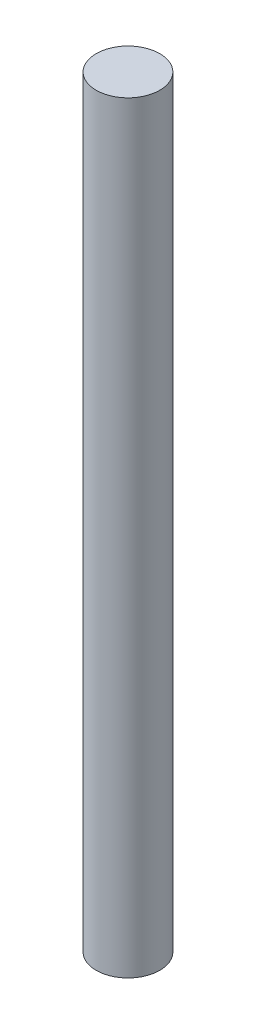
ISO-10303-21;
HEADER;
FILE_DESCRIPTION(('STEP AP214'),'2;1');
FILE_NAME('part.step','',(''),(''),'','','');
FILE_SCHEMA(('AUTOMOTIVE_DESIGN { 1 0 10303 214 1 1 1 1 }'));
ENDSEC;
DATA;
#1=APPLICATION_CONTEXT('core data for automotive mechanical design processes');
#2=APPLICATION_PROTOCOL_DEFINITION('international standard','automotive_design',2000,#1);
#3=PRODUCT_CONTEXT('',#1,'mechanical');
#4=PRODUCT('Part','Part','',(#3));
#5=PRODUCT_RELATED_PRODUCT_CATEGORY('part','',(#4));
#6=PRODUCT_DEFINITION_FORMATION('','',#4);
#7=PRODUCT_DEFINITION_CONTEXT('part definition',#1,'design');
#8=PRODUCT_DEFINITION('design','',#6,#7);
#9=PRODUCT_DEFINITION_SHAPE('','',#8);
#10=(LENGTH_UNIT() NAMED_UNIT(*) SI_UNIT(.MILLI.,.METRE.));
#11=(NAMED_UNIT(*) PLANE_ANGLE_UNIT() SI_UNIT($,.RADIAN.));
#12=(NAMED_UNIT(*) SI_UNIT($,.STERADIAN.) SOLID_ANGLE_UNIT());
#13=UNCERTAINTY_MEASURE_WITH_UNIT(LENGTH_MEASURE(1.E-05),#10,'distance_accuracy_value','');
#14=(GEOMETRIC_REPRESENTATION_CONTEXT(3) GLOBAL_UNCERTAINTY_ASSIGNED_CONTEXT((#13)) GLOBAL_UNIT_ASSIGNED_CONTEXT((#10,
#11,#12)) REPRESENTATION_CONTEXT('',''));
#15=CARTESIAN_POINT('',(0.,0.,0.));
#16=DIRECTION('',(0.,0.,1.));
#17=DIRECTION('',(1.,0.,0.));
#18=AXIS2_PLACEMENT_3D('',#15,#16,#17);
#19=CARTESIAN_POINT('',(0.,152.4,0.));
#20=DIRECTION('',(0.,-1.,0.));
#21=DIRECTION('',(0.,0.,-1.));
#22=AXIS2_PLACEMENT_3D('',#19,#20,#21);
#23=CYLINDRICAL_SURFACE('',#22,6.35);
#24=CARTESIAN_POINT('',(0.,152.4,0.));
#25=DIRECTION('',(0.,1.,0.));
#26=DIRECTION('',(0.,0.,1.));
#27=AXIS2_PLACEMENT_3D('',#24,#25,#26);
#28=CIRCLE('',#27,6.35);
#29=CARTESIAN_POINT('',(0.,152.4,6.35));
#30=VERTEX_POINT('',#29);
#31=EDGE_CURVE('E10',#30,#30,#28,.T.);
#32=ORIENTED_EDGE('',*,*,#31,.F.);
#33=EDGE_LOOP('',(#32));
#34=FACE_BOUND('',#33,.T.);
#35=CARTESIAN_POINT('',(0.,0.,0.));
#36=DIRECTION('',(0.,1.,0.));
#37=DIRECTION('',(0.,0.,1.));
#38=AXIS2_PLACEMENT_3D('',#35,#36,#37);
#39=CIRCLE('',#38,6.35);
#40=CARTESIAN_POINT('',(0.,0.,6.35));
#41=VERTEX_POINT('',#40);
#42=EDGE_CURVE('E35',#41,#41,#39,.T.);
#43=ORIENTED_EDGE('',*,*,#42,.T.);
#44=EDGE_LOOP('',(#43));
#45=FACE_BOUND('',#44,.T.);
#46=ADVANCED_FACE('F32',(#34,#45),#23,.T.);
#47=CARTESIAN_POINT('',(0.,152.4,0.));
#48=DIRECTION('',(0.,1.,0.));
#49=DIRECTION('',(0.,0.,1.));
#50=AXIS2_PLACEMENT_3D('',#47,#48,#49);
#51=PLANE('',#50);
#52=ORIENTED_EDGE('',*,*,#31,.T.);
#53=EDGE_LOOP('',(#52));
#54=FACE_BOUND('',#53,.T.);
#55=ADVANCED_FACE('F47',(#54),#51,.T.);
#56=CARTESIAN_POINT('',(0.,0.,0.));
#57=DIRECTION('',(0.,1.,0.));
#58=DIRECTION('',(0.,0.,1.));
#59=AXIS2_PLACEMENT_3D('',#56,#57,#58);
#60=PLANE('',#59);
#61=ORIENTED_EDGE('',*,*,#42,.F.);
#62=EDGE_LOOP('',(#61));
#63=FACE_BOUND('',#62,.T.);
#64=ADVANCED_FACE('F45',(#63),#60,.F.);
#65=CLOSED_SHELL('',(#46,#55,#64));
#66=MANIFOLD_SOLID_BREP('B2',#65);
#67=ADVANCED_BREP_SHAPE_REPRESENTATION('',(#18,#66),#14);
#68=SHAPE_DEFINITION_REPRESENTATION(#9,#67);
ENDSEC;
END-ISO-10303-21;
